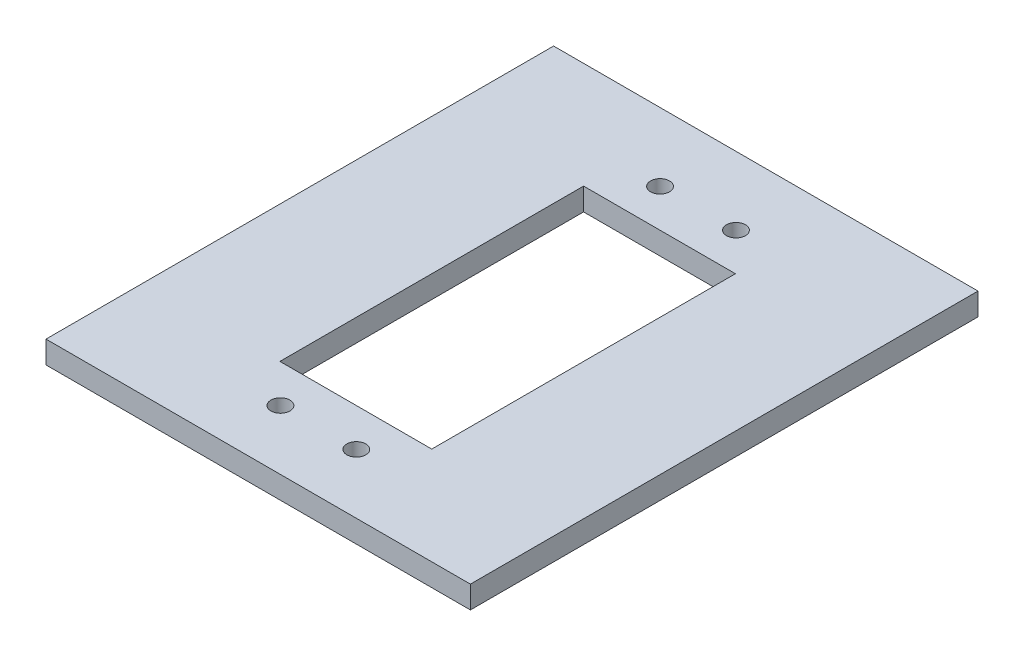
ISO-10303-21;
HEADER;
FILE_DESCRIPTION(('STEP AP214'),'2;1');
FILE_NAME('part.step','',(''),(''),'','','');
FILE_SCHEMA(('AUTOMOTIVE_DESIGN { 1 0 10303 214 1 1 1 1 }'));
ENDSEC;
DATA;
#1=APPLICATION_CONTEXT('core data for automotive mechanical design processes');
#2=APPLICATION_PROTOCOL_DEFINITION('international standard','automotive_design',2000,#1);
#3=PRODUCT_CONTEXT('',#1,'mechanical');
#4=PRODUCT('Part','Part','',(#3));
#5=PRODUCT_RELATED_PRODUCT_CATEGORY('part','',(#4));
#6=PRODUCT_DEFINITION_FORMATION('','',#4);
#7=PRODUCT_DEFINITION_CONTEXT('part definition',#1,'design');
#8=PRODUCT_DEFINITION('design','',#6,#7);
#9=PRODUCT_DEFINITION_SHAPE('','',#8);
#10=(LENGTH_UNIT() NAMED_UNIT(*) SI_UNIT(.MILLI.,.METRE.));
#11=(NAMED_UNIT(*) PLANE_ANGLE_UNIT() SI_UNIT($,.RADIAN.));
#12=(NAMED_UNIT(*) SI_UNIT($,.STERADIAN.) SOLID_ANGLE_UNIT());
#13=UNCERTAINTY_MEASURE_WITH_UNIT(LENGTH_MEASURE(1.E-05),#10,'distance_accuracy_value','');
#14=(GEOMETRIC_REPRESENTATION_CONTEXT(3) GLOBAL_UNCERTAINTY_ASSIGNED_CONTEXT((#13)) GLOBAL_UNIT_ASSIGNED_CONTEXT((#10,
#11,#12)) REPRESENTATION_CONTEXT('',''));
#15=CARTESIAN_POINT('',(0.,0.,0.));
#16=DIRECTION('',(0.,0.,1.));
#17=DIRECTION('',(1.,0.,0.));
#18=AXIS2_PLACEMENT_3D('',#15,#16,#17);
#19=CARTESIAN_POINT('',(-24.7477327325693,2.95,-34.1827307992514));
#20=DIRECTION('',(1.,0.,0.));
#21=DIRECTION('',(0.,0.,-1.));
#22=AXIS2_PLACEMENT_3D('',#19,#20,#21);
#23=PLANE('',#22);
#24=DIRECTION('',(0.,0.,1.));
#25=VECTOR('',#24,1.);
#26=CARTESIAN_POINT('',(-24.7477327325693,0.,-34.1827307992514));
#27=LINE('',#26,#25);
#28=CARTESIAN_POINT('',(-24.7477327325693,0.,-34.1827307992514));
#29=VERTEX_POINT('',#28);
#30=CARTESIAN_POINT('',(-24.7477327325693,0.,32.6772692007486));
#31=VERTEX_POINT('',#30);
#32=EDGE_CURVE('E125',#29,#31,#27,.T.);
#33=ORIENTED_EDGE('',*,*,#32,.T.);
#34=DIRECTION('',(0.,-1.,0.));
#35=VECTOR('',#34,1.);
#36=CARTESIAN_POINT('',(-24.7477327325693,2.95,32.6772692007486));
#37=LINE('',#36,#35);
#38=CARTESIAN_POINT('',(-24.7477327325693,2.95,32.6772692007486));
#39=VERTEX_POINT('',#38);
#40=EDGE_CURVE('E154',#39,#31,#37,.T.);
#41=ORIENTED_EDGE('',*,*,#40,.F.);
#42=DIRECTION('',(0.,0.,1.));
#43=VECTOR('',#42,1.);
#44=CARTESIAN_POINT('',(-24.7477327325693,2.95,-34.1827307992514));
#45=LINE('',#44,#43);
#46=CARTESIAN_POINT('',(-24.7477327325693,2.95,-34.1827307992514));
#47=VERTEX_POINT('',#46);
#48=EDGE_CURVE('E128',#47,#39,#45,.T.);
#49=ORIENTED_EDGE('',*,*,#48,.F.);
#50=DIRECTION('',(0.,-1.,0.));
#51=VECTOR('',#50,1.);
#52=CARTESIAN_POINT('',(-24.7477327325693,2.95,-34.1827307992514));
#53=LINE('',#52,#51);
#54=EDGE_CURVE('E138',#47,#29,#53,.T.);
#55=ORIENTED_EDGE('',*,*,#54,.T.);
#56=EDGE_LOOP('',(#33,#41,#49,#55));
#57=FACE_BOUND('',#56,.T.);
#58=ADVANCED_FACE('F33',(#57),#23,.F.);
#59=CARTESIAN_POINT('',(-24.7477327325693,2.95,32.6772692007486));
#60=DIRECTION('',(0.,0.,-1.));
#61=DIRECTION('',(-1.,0.,0.));
#62=AXIS2_PLACEMENT_3D('',#59,#60,#61);
#63=PLANE('',#62);
#64=DIRECTION('',(1.,0.,0.));
#65=VECTOR('',#64,1.);
#66=CARTESIAN_POINT('',(-24.7477327325693,0.,32.6772692007486));
#67=LINE('',#66,#65);
#68=CARTESIAN_POINT('',(31.1522672674307,0.,32.6772692007486));
#69=VERTEX_POINT('',#68);
#70=EDGE_CURVE('E141',#31,#69,#67,.T.);
#71=ORIENTED_EDGE('',*,*,#70,.T.);
#72=DIRECTION('',(0.,-1.,0.));
#73=VECTOR('',#72,1.);
#74=CARTESIAN_POINT('',(31.1522672674307,2.95,32.6772692007486));
#75=LINE('',#74,#73);
#76=CARTESIAN_POINT('',(31.1522672674307,2.95,32.6772692007486));
#77=VERTEX_POINT('',#76);
#78=EDGE_CURVE('E151',#77,#69,#75,.T.);
#79=ORIENTED_EDGE('',*,*,#78,.F.);
#80=DIRECTION('',(1.,0.,0.));
#81=VECTOR('',#80,1.);
#82=CARTESIAN_POINT('',(-24.7477327325693,2.95,32.6772692007486));
#83=LINE('',#82,#81);
#84=EDGE_CURVE('E131',#39,#77,#83,.T.);
#85=ORIENTED_EDGE('',*,*,#84,.F.);
#86=ORIENTED_EDGE('',*,*,#40,.T.);
#87=EDGE_LOOP('',(#71,#79,#85,#86));
#88=FACE_BOUND('',#87,.T.);
#89=ADVANCED_FACE('F225',(#88),#63,.F.);
#90=CARTESIAN_POINT('',(31.1522672674307,2.95,-34.1827307992514));
#91=DIRECTION('',(-1.,0.,0.));
#92=DIRECTION('',(0.,0.,1.));
#93=AXIS2_PLACEMENT_3D('',#90,#91,#92);
#94=PLANE('',#93);
#95=DIRECTION('',(0.,0.,-1.));
#96=VECTOR('',#95,1.);
#97=CARTESIAN_POINT('',(31.1522672674307,0.,-34.1827307992514));
#98=LINE('',#97,#96);
#99=CARTESIAN_POINT('',(31.1522672674307,0.,-34.1827307992514));
#100=VERTEX_POINT('',#99);
#101=EDGE_CURVE('E143',#69,#100,#98,.T.);
#102=ORIENTED_EDGE('',*,*,#101,.T.);
#103=DIRECTION('',(0.,-1.,0.));
#104=VECTOR('',#103,1.);
#105=CARTESIAN_POINT('',(31.1522672674307,2.95,-34.1827307992514));
#106=LINE('',#105,#104);
#107=CARTESIAN_POINT('',(31.1522672674307,2.95,-34.1827307992514));
#108=VERTEX_POINT('',#107);
#109=EDGE_CURVE('E148',#108,#100,#106,.T.);
#110=ORIENTED_EDGE('',*,*,#109,.F.);
#111=DIRECTION('',(0.,0.,-1.));
#112=VECTOR('',#111,1.);
#113=CARTESIAN_POINT('',(31.1522672674307,2.95,-34.1827307992514));
#114=LINE('',#113,#112);
#115=EDGE_CURVE('E134',#77,#108,#114,.T.);
#116=ORIENTED_EDGE('',*,*,#115,.F.);
#117=ORIENTED_EDGE('',*,*,#78,.T.);
#118=EDGE_LOOP('',(#102,#110,#116,#117));
#119=FACE_BOUND('',#118,.T.);
#120=ADVANCED_FACE('F222',(#119),#94,.F.);
#121=CARTESIAN_POINT('',(-24.7477327325693,2.95,-34.1827307992514));
#122=DIRECTION('',(0.,0.,1.));
#123=DIRECTION('',(1.,0.,0.));
#124=AXIS2_PLACEMENT_3D('',#121,#122,#123);
#125=PLANE('',#124);
#126=DIRECTION('',(-1.,0.,0.));
#127=VECTOR('',#126,1.);
#128=CARTESIAN_POINT('',(-24.7477327325693,0.,-34.1827307992514));
#129=LINE('',#128,#127);
#130=EDGE_CURVE('E132',#100,#29,#129,.T.);
#131=ORIENTED_EDGE('',*,*,#130,.T.);
#132=ORIENTED_EDGE('',*,*,#54,.F.);
#133=DIRECTION('',(-1.,0.,0.));
#134=VECTOR('',#133,1.);
#135=CARTESIAN_POINT('',(-24.7477327325693,2.95,-34.1827307992514));
#136=LINE('',#135,#134);
#137=EDGE_CURVE('E136',#108,#47,#136,.T.);
#138=ORIENTED_EDGE('',*,*,#137,.F.);
#139=ORIENTED_EDGE('',*,*,#109,.T.);
#140=EDGE_LOOP('',(#131,#132,#138,#139));
#141=FACE_BOUND('',#140,.T.);
#142=ADVANCED_FACE('F194',(#141),#125,.F.);
#143=CARTESIAN_POINT('',(0.,2.95,0.));
#144=DIRECTION('',(0.,1.,0.));
#145=DIRECTION('',(0.,0.,1.));
#146=AXIS2_PLACEMENT_3D('',#143,#144,#145);
#147=PLANE('',#146);
#148=CARTESIAN_POINT('',(-1.72957698718127,2.95,-25.1827307992514));
#149=DIRECTION('',(0.,1.,0.));
#150=DIRECTION('',(0.,0.,1.));
#151=AXIS2_PLACEMENT_3D('',#148,#149,#150);
#152=CIRCLE('',#151,1.25);
#153=CARTESIAN_POINT('',(-1.72957698718127,2.95,-23.9327307992514));
#154=VERTEX_POINT('',#153);
#155=EDGE_CURVE('E178',#154,#154,#152,.T.);
#156=ORIENTED_EDGE('',*,*,#155,.F.);
#157=EDGE_LOOP('',(#156));
#158=FACE_BOUND('',#157,.T.);
#159=CARTESIAN_POINT('',(8.27042301281872,2.95,24.8172692007486));
#160=DIRECTION('',(0.,1.,0.));
#161=DIRECTION('',(0.,0.,1.));
#162=AXIS2_PLACEMENT_3D('',#159,#160,#161);
#163=CIRCLE('',#162,1.25);
#164=CARTESIAN_POINT('',(8.27042301281872,2.95,26.0672692007486));
#165=VERTEX_POINT('',#164);
#166=EDGE_CURVE('E179',#165,#165,#163,.T.);
#167=ORIENTED_EDGE('',*,*,#166,.F.);
#168=EDGE_LOOP('',(#167));
#169=FACE_BOUND('',#168,.T.);
#170=CARTESIAN_POINT('',(8.27042301281873,2.95,-25.1827307992514));
#171=DIRECTION('',(0.,1.,0.));
#172=DIRECTION('',(0.,0.,1.));
#173=AXIS2_PLACEMENT_3D('',#170,#171,#172);
#174=CIRCLE('',#173,1.25);
#175=CARTESIAN_POINT('',(8.27042301281873,2.95,-23.9327307992514));
#176=VERTEX_POINT('',#175);
#177=EDGE_CURVE('E182',#176,#176,#174,.T.);
#178=ORIENTED_EDGE('',*,*,#177,.F.);
#179=EDGE_LOOP('',(#178));
#180=FACE_BOUND('',#179,.T.);
#181=CARTESIAN_POINT('',(-1.72957698718128,2.95,24.8172692007486));
#182=DIRECTION('',(0.,1.,0.));
#183=DIRECTION('',(0.,0.,1.));
#184=AXIS2_PLACEMENT_3D('',#181,#182,#183);
#185=CIRCLE('',#184,1.25);
#186=CARTESIAN_POINT('',(-1.72957698718128,2.95,26.0672692007486));
#187=VERTEX_POINT('',#186);
#188=EDGE_CURVE('E166',#187,#187,#185,.T.);
#189=ORIENTED_EDGE('',*,*,#188,.F.);
#190=EDGE_LOOP('',(#189));
#191=FACE_BOUND('',#190,.T.);
#192=DIRECTION('',(0.,0.,1.));
#193=VECTOR('',#192,1.);
#194=CARTESIAN_POINT('',(-6.79773273256926,2.95,-20.1827307992514));
#195=LINE('',#194,#193);
#196=CARTESIAN_POINT('',(-6.79773273256926,2.95,-20.1827307992514));
#197=VERTEX_POINT('',#196);
#198=CARTESIAN_POINT('',(-6.79773273256926,2.95,19.8172692007486));
#199=VERTEX_POINT('',#198);
#200=EDGE_CURVE('E49',#197,#199,#195,.T.);
#201=ORIENTED_EDGE('',*,*,#200,.F.);
#202=DIRECTION('',(-1.,0.,0.));
#203=VECTOR('',#202,1.);
#204=CARTESIAN_POINT('',(-6.79773273256926,2.95,-20.1827307992514));
#205=LINE('',#204,#203);
#206=CARTESIAN_POINT('',(13.2022672674307,2.95,-20.1827307992514));
#207=VERTEX_POINT('',#206);
#208=EDGE_CURVE('E118',#207,#197,#205,.T.);
#209=ORIENTED_EDGE('',*,*,#208,.F.);
#210=DIRECTION('',(0.,0.,-1.));
#211=VECTOR('',#210,1.);
#212=CARTESIAN_POINT('',(13.2022672674307,2.95,-20.1827307992514));
#213=LINE('',#212,#211);
#214=CARTESIAN_POINT('',(13.2022672674307,2.95,19.8172692007486));
#215=VERTEX_POINT('',#214);
#216=EDGE_CURVE('E102',#215,#207,#213,.T.);
#217=ORIENTED_EDGE('',*,*,#216,.F.);
#218=DIRECTION('',(1.,0.,0.));
#219=VECTOR('',#218,1.);
#220=CARTESIAN_POINT('',(-6.79773273256926,2.95,19.8172692007486));
#221=LINE('',#220,#219);
#222=EDGE_CURVE('E111',#199,#215,#221,.T.);
#223=ORIENTED_EDGE('',*,*,#222,.F.);
#224=EDGE_LOOP('',(#201,#209,#217,#223));
#225=FACE_BOUND('',#224,.T.);
#226=ORIENTED_EDGE('',*,*,#48,.T.);
#227=ORIENTED_EDGE('',*,*,#84,.T.);
#228=ORIENTED_EDGE('',*,*,#115,.T.);
#229=ORIENTED_EDGE('',*,*,#137,.T.);
#230=EDGE_LOOP('',(#226,#227,#228,#229));
#231=FACE_BOUND('',#230,.T.);
#232=ADVANCED_FACE('F115',(#158,#169,#180,#191,#225,#231),#147,.T.);
#233=CARTESIAN_POINT('',(0.,0.,0.));
#234=DIRECTION('',(0.,1.,0.));
#235=DIRECTION('',(0.,0.,1.));
#236=AXIS2_PLACEMENT_3D('',#233,#234,#235);
#237=PLANE('',#236);
#238=CARTESIAN_POINT('',(-1.72957698718127,0.,-25.1827307992514));
#239=DIRECTION('',(0.,1.,0.));
#240=DIRECTION('',(0.,0.,1.));
#241=AXIS2_PLACEMENT_3D('',#238,#239,#240);
#242=CIRCLE('',#241,1.25);
#243=CARTESIAN_POINT('',(-1.72957698718127,0.,-23.9327307992514));
#244=VERTEX_POINT('',#243);
#245=EDGE_CURVE('E36',#244,#244,#242,.T.);
#246=ORIENTED_EDGE('',*,*,#245,.T.);
#247=EDGE_LOOP('',(#246));
#248=FACE_BOUND('',#247,.T.);
#249=CARTESIAN_POINT('',(8.27042301281872,0.,24.8172692007486));
#250=DIRECTION('',(0.,1.,0.));
#251=DIRECTION('',(0.,0.,1.));
#252=AXIS2_PLACEMENT_3D('',#249,#250,#251);
#253=CIRCLE('',#252,1.25);
#254=CARTESIAN_POINT('',(8.27042301281872,0.,26.0672692007486));
#255=VERTEX_POINT('',#254);
#256=EDGE_CURVE('E168',#255,#255,#253,.T.);
#257=ORIENTED_EDGE('',*,*,#256,.T.);
#258=EDGE_LOOP('',(#257));
#259=FACE_BOUND('',#258,.T.);
#260=CARTESIAN_POINT('',(8.27042301281873,0.,-25.1827307992514));
#261=DIRECTION('',(0.,1.,0.));
#262=DIRECTION('',(0.,0.,1.));
#263=AXIS2_PLACEMENT_3D('',#260,#261,#262);
#264=CIRCLE('',#263,1.25);
#265=CARTESIAN_POINT('',(8.27042301281873,0.,-23.9327307992514));
#266=VERTEX_POINT('',#265);
#267=EDGE_CURVE('E165',#266,#266,#264,.T.);
#268=ORIENTED_EDGE('',*,*,#267,.T.);
#269=EDGE_LOOP('',(#268));
#270=FACE_BOUND('',#269,.T.);
#271=CARTESIAN_POINT('',(-1.72957698718128,0.,24.8172692007486));
#272=DIRECTION('',(0.,1.,0.));
#273=DIRECTION('',(0.,0.,1.));
#274=AXIS2_PLACEMENT_3D('',#271,#272,#273);
#275=CIRCLE('',#274,1.25);
#276=CARTESIAN_POINT('',(-1.72957698718128,0.,26.0672692007486));
#277=VERTEX_POINT('',#276);
#278=EDGE_CURVE('E162',#277,#277,#275,.T.);
#279=ORIENTED_EDGE('',*,*,#278,.T.);
#280=EDGE_LOOP('',(#279));
#281=FACE_BOUND('',#280,.T.);
#282=DIRECTION('',(-1.,0.,0.));
#283=VECTOR('',#282,1.);
#284=CARTESIAN_POINT('',(0.,0.,-20.1827307992514));
#285=LINE('',#284,#283);
#286=CARTESIAN_POINT('',(13.2022672674307,0.,-20.1827307992514));
#287=VERTEX_POINT('',#286);
#288=CARTESIAN_POINT('',(-6.79773273256926,0.,-20.1827307992514));
#289=VERTEX_POINT('',#288);
#290=EDGE_CURVE('E41',#287,#289,#285,.T.);
#291=ORIENTED_EDGE('',*,*,#290,.T.);
#292=DIRECTION('',(0.,0.,1.));
#293=VECTOR('',#292,1.);
#294=CARTESIAN_POINT('',(-6.79773273256926,0.,0.));
#295=LINE('',#294,#293);
#296=CARTESIAN_POINT('',(-6.79773273256926,0.,19.8172692007486));
#297=VERTEX_POINT('',#296);
#298=EDGE_CURVE('E11',#289,#297,#295,.T.);
#299=ORIENTED_EDGE('',*,*,#298,.T.);
#300=DIRECTION('',(1.,0.,0.));
#301=VECTOR('',#300,1.);
#302=CARTESIAN_POINT('',(0.,0.,19.8172692007486));
#303=LINE('',#302,#301);
#304=CARTESIAN_POINT('',(13.2022672674307,0.,19.8172692007486));
#305=VERTEX_POINT('',#304);
#306=EDGE_CURVE('E157',#297,#305,#303,.T.);
#307=ORIENTED_EDGE('',*,*,#306,.T.);
#308=DIRECTION('',(0.,0.,-1.));
#309=VECTOR('',#308,1.);
#310=CARTESIAN_POINT('',(13.2022672674307,0.,0.));
#311=LINE('',#310,#309);
#312=EDGE_CURVE('E105',#305,#287,#311,.T.);
#313=ORIENTED_EDGE('',*,*,#312,.T.);
#314=EDGE_LOOP('',(#291,#299,#307,#313));
#315=FACE_BOUND('',#314,.T.);
#316=ORIENTED_EDGE('',*,*,#32,.F.);
#317=ORIENTED_EDGE('',*,*,#130,.F.);
#318=ORIENTED_EDGE('',*,*,#101,.F.);
#319=ORIENTED_EDGE('',*,*,#70,.F.);
#320=EDGE_LOOP('',(#316,#317,#318,#319));
#321=FACE_BOUND('',#320,.T.);
#322=ADVANCED_FACE('F193',(#248,#259,#270,#281,#315,#321),#237,.F.);
#323=CARTESIAN_POINT('',(-6.79773273256926,-3.91,-20.1827307992514));
#324=DIRECTION('',(-1.,0.,0.));
#325=DIRECTION('',(0.,0.,1.));
#326=AXIS2_PLACEMENT_3D('',#323,#324,#325);
#327=PLANE('',#326);
#328=DIRECTION('',(0.,1.,0.));
#329=VECTOR('',#328,1.);
#330=CARTESIAN_POINT('',(-6.79773273256926,-3.91,-20.1827307992514));
#331=LINE('',#330,#329);
#332=EDGE_CURVE('E123',#289,#197,#331,.T.);
#333=ORIENTED_EDGE('',*,*,#332,.T.);
#334=ORIENTED_EDGE('',*,*,#200,.T.);
#335=DIRECTION('',(0.,1.,0.));
#336=VECTOR('',#335,1.);
#337=CARTESIAN_POINT('',(-6.79773273256926,-3.91,19.8172692007486));
#338=LINE('',#337,#336);
#339=EDGE_CURVE('E108',#297,#199,#338,.T.);
#340=ORIENTED_EDGE('',*,*,#339,.F.);
#341=ORIENTED_EDGE('',*,*,#298,.F.);
#342=EDGE_LOOP('',(#333,#334,#340,#341));
#343=FACE_BOUND('',#342,.T.);
#344=ADVANCED_FACE('F207',(#343),#327,.F.);
#345=CARTESIAN_POINT('',(-6.79773273256926,-3.91,-20.1827307992514));
#346=DIRECTION('',(0.,0.,-1.));
#347=DIRECTION('',(-1.,0.,0.));
#348=AXIS2_PLACEMENT_3D('',#345,#346,#347);
#349=PLANE('',#348);
#350=DIRECTION('',(0.,1.,0.));
#351=VECTOR('',#350,1.);
#352=CARTESIAN_POINT('',(13.2022672674307,-3.91,-20.1827307992514));
#353=LINE('',#352,#351);
#354=EDGE_CURVE('E107',#287,#207,#353,.T.);
#355=ORIENTED_EDGE('',*,*,#354,.T.);
#356=ORIENTED_EDGE('',*,*,#208,.T.);
#357=ORIENTED_EDGE('',*,*,#332,.F.);
#358=ORIENTED_EDGE('',*,*,#290,.F.);
#359=EDGE_LOOP('',(#355,#356,#357,#358));
#360=FACE_BOUND('',#359,.T.);
#361=ADVANCED_FACE('F237',(#360),#349,.F.);
#362=CARTESIAN_POINT('',(13.2022672674307,-3.91,-20.1827307992514));
#363=DIRECTION('',(1.,0.,0.));
#364=DIRECTION('',(0.,0.,-1.));
#365=AXIS2_PLACEMENT_3D('',#362,#363,#364);
#366=PLANE('',#365);
#367=DIRECTION('',(0.,1.,0.));
#368=VECTOR('',#367,1.);
#369=CARTESIAN_POINT('',(13.2022672674307,-3.91,19.8172692007486));
#370=LINE('',#369,#368);
#371=EDGE_CURVE('E57',#305,#215,#370,.T.);
#372=ORIENTED_EDGE('',*,*,#371,.T.);
#373=ORIENTED_EDGE('',*,*,#216,.T.);
#374=ORIENTED_EDGE('',*,*,#354,.F.);
#375=ORIENTED_EDGE('',*,*,#312,.F.);
#376=EDGE_LOOP('',(#372,#373,#374,#375));
#377=FACE_BOUND('',#376,.T.);
#378=ADVANCED_FACE('F99',(#377),#366,.F.);
#379=CARTESIAN_POINT('',(-6.79773273256926,-3.91,19.8172692007486));
#380=DIRECTION('',(0.,0.,1.));
#381=DIRECTION('',(1.,0.,0.));
#382=AXIS2_PLACEMENT_3D('',#379,#380,#381);
#383=PLANE('',#382);
#384=ORIENTED_EDGE('',*,*,#339,.T.);
#385=ORIENTED_EDGE('',*,*,#222,.T.);
#386=ORIENTED_EDGE('',*,*,#371,.F.);
#387=ORIENTED_EDGE('',*,*,#306,.F.);
#388=EDGE_LOOP('',(#384,#385,#386,#387));
#389=FACE_BOUND('',#388,.T.);
#390=ADVANCED_FACE('F112',(#389),#383,.F.);
#391=CARTESIAN_POINT('',(-1.72957698718128,-3.91,24.8172692007486));
#392=DIRECTION('',(0.,1.,0.));
#393=DIRECTION('',(0.,0.,1.));
#394=AXIS2_PLACEMENT_3D('',#391,#392,#393);
#395=CYLINDRICAL_SURFACE('',#394,1.25);
#396=ORIENTED_EDGE('',*,*,#188,.T.);
#397=EDGE_LOOP('',(#396));
#398=FACE_BOUND('',#397,.T.);
#399=ORIENTED_EDGE('',*,*,#278,.F.);
#400=EDGE_LOOP('',(#399));
#401=FACE_BOUND('',#400,.T.);
#402=ADVANCED_FACE('F199',(#398,#401),#395,.F.);
#403=CARTESIAN_POINT('',(8.27042301281873,-3.91,-25.1827307992514));
#404=DIRECTION('',(0.,1.,0.));
#405=DIRECTION('',(0.,0.,1.));
#406=AXIS2_PLACEMENT_3D('',#403,#404,#405);
#407=CYLINDRICAL_SURFACE('',#406,1.25);
#408=ORIENTED_EDGE('',*,*,#177,.T.);
#409=EDGE_LOOP('',(#408));
#410=FACE_BOUND('',#409,.T.);
#411=ORIENTED_EDGE('',*,*,#267,.F.);
#412=EDGE_LOOP('',(#411));
#413=FACE_BOUND('',#412,.T.);
#414=ADVANCED_FACE('F188',(#410,#413),#407,.F.);
#415=CARTESIAN_POINT('',(8.27042301281872,-3.91,24.8172692007486));
#416=DIRECTION('',(0.,1.,0.));
#417=DIRECTION('',(0.,0.,1.));
#418=AXIS2_PLACEMENT_3D('',#415,#416,#417);
#419=CYLINDRICAL_SURFACE('',#418,1.25);
#420=ORIENTED_EDGE('',*,*,#166,.T.);
#421=EDGE_LOOP('',(#420));
#422=FACE_BOUND('',#421,.T.);
#423=ORIENTED_EDGE('',*,*,#256,.F.);
#424=EDGE_LOOP('',(#423));
#425=FACE_BOUND('',#424,.T.);
#426=ADVANCED_FACE('F245',(#422,#425),#419,.F.);
#427=CARTESIAN_POINT('',(-1.72957698718127,-3.91,-25.1827307992514));
#428=DIRECTION('',(0.,1.,0.));
#429=DIRECTION('',(0.,0.,1.));
#430=AXIS2_PLACEMENT_3D('',#427,#428,#429);
#431=CYLINDRICAL_SURFACE('',#430,1.25);
#432=ORIENTED_EDGE('',*,*,#155,.T.);
#433=EDGE_LOOP('',(#432));
#434=FACE_BOUND('',#433,.T.);
#435=ORIENTED_EDGE('',*,*,#245,.F.);
#436=EDGE_LOOP('',(#435));
#437=FACE_BOUND('',#436,.T.);
#438=ADVANCED_FACE('F248',(#434,#437),#431,.F.);
#439=CLOSED_SHELL('',(#58,#89,#120,#142,#232,#322,#344,#361,#378,#390,#402,#414,#426,#438));
#440=MANIFOLD_SOLID_BREP('B2',#439);
#441=ADVANCED_BREP_SHAPE_REPRESENTATION('',(#18,#440),#14);
#442=SHAPE_DEFINITION_REPRESENTATION(#9,#441);
ENDSEC;
END-ISO-10303-21;
